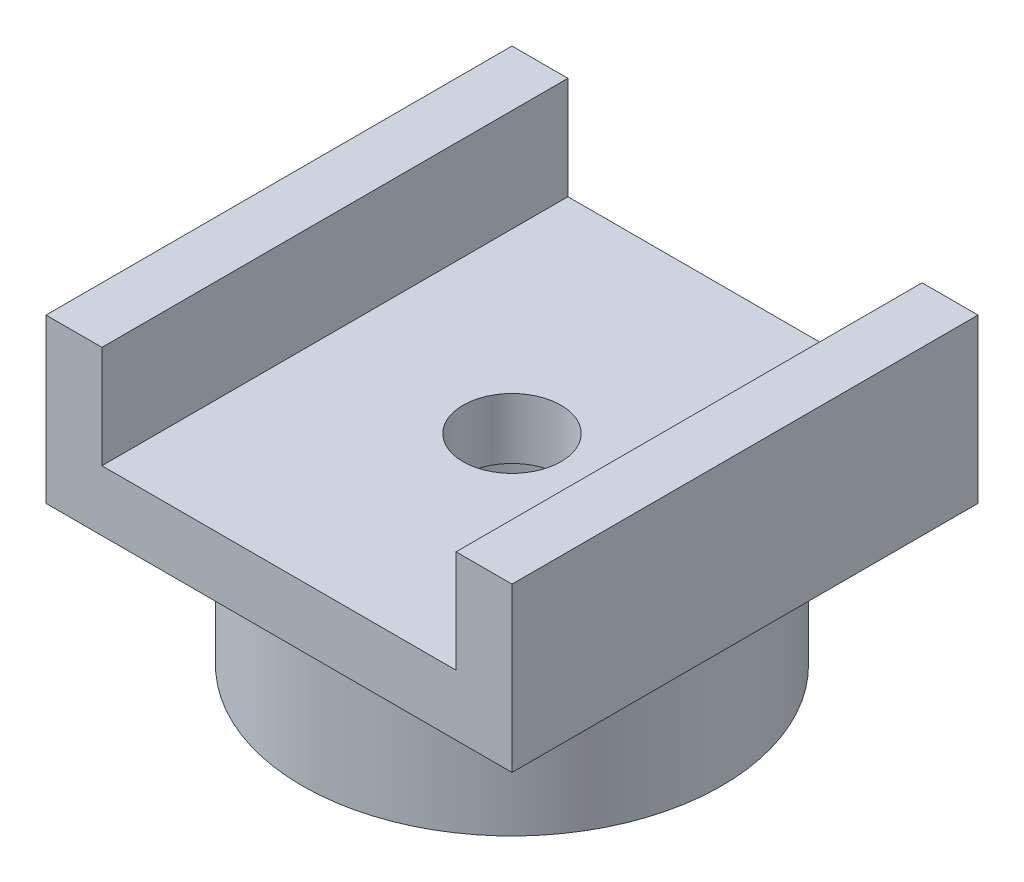
ISO-10303-21;
HEADER;
FILE_DESCRIPTION(('STEP AP214'),'2;1');
FILE_NAME('part.step','',(''),(''),'','','');
FILE_SCHEMA(('AUTOMOTIVE_DESIGN { 1 0 10303 214 1 1 1 1 }'));
ENDSEC;
DATA;
#1=APPLICATION_CONTEXT('core data for automotive mechanical design processes');
#2=APPLICATION_PROTOCOL_DEFINITION('international standard','automotive_design',2000,#1);
#3=PRODUCT_CONTEXT('',#1,'mechanical');
#4=PRODUCT('Part','Part','',(#3));
#5=PRODUCT_RELATED_PRODUCT_CATEGORY('part','',(#4));
#6=PRODUCT_DEFINITION_FORMATION('','',#4);
#7=PRODUCT_DEFINITION_CONTEXT('part definition',#1,'design');
#8=PRODUCT_DEFINITION('design','',#6,#7);
#9=PRODUCT_DEFINITION_SHAPE('','',#8);
#10=(LENGTH_UNIT() NAMED_UNIT(*) SI_UNIT(.MILLI.,.METRE.));
#11=(NAMED_UNIT(*) PLANE_ANGLE_UNIT() SI_UNIT($,.RADIAN.));
#12=(NAMED_UNIT(*) SI_UNIT($,.STERADIAN.) SOLID_ANGLE_UNIT());
#13=UNCERTAINTY_MEASURE_WITH_UNIT(LENGTH_MEASURE(1.E-05),#10,'distance_accuracy_value','');
#14=(GEOMETRIC_REPRESENTATION_CONTEXT(3) GLOBAL_UNCERTAINTY_ASSIGNED_CONTEXT((#13)) GLOBAL_UNIT_ASSIGNED_CONTEXT((#10,
#11,#12)) REPRESENTATION_CONTEXT('',''));
#15=CARTESIAN_POINT('',(0.,0.,0.));
#16=DIRECTION('',(0.,0.,1.));
#17=DIRECTION('',(1.,0.,0.));
#18=AXIS2_PLACEMENT_3D('',#15,#16,#17);
#19=CARTESIAN_POINT('',(5.,6.5,-5.));
#20=DIRECTION('',(0.,-1.,0.));
#21=DIRECTION('',(0.,0.,-1.));
#22=AXIS2_PLACEMENT_3D('',#19,#20,#21);
#23=PLANE('',#22);
#24=DIRECTION('',(1.,0.,0.));
#25=VECTOR('',#24,1.);
#26=CARTESIAN_POINT('',(-5.,6.5,5.));
#27=LINE('',#26,#25);
#28=CARTESIAN_POINT('',(-5.,6.5,5.));
#29=VERTEX_POINT('',#28);
#30=CARTESIAN_POINT('',(-3.8,6.5,5.));
#31=VERTEX_POINT('',#30);
#32=EDGE_CURVE('E150',#29,#31,#27,.T.);
#33=ORIENTED_EDGE('',*,*,#32,.T.);
#34=DIRECTION('',(0.,0.,1.));
#35=VECTOR('',#34,1.);
#36=CARTESIAN_POINT('',(-3.8,6.5,-5.));
#37=LINE('',#36,#35);
#38=CARTESIAN_POINT('',(-3.8,6.5,-5.));
#39=VERTEX_POINT('',#38);
#40=EDGE_CURVE('E113',#39,#31,#37,.T.);
#41=ORIENTED_EDGE('',*,*,#40,.F.);
#42=DIRECTION('',(-1.,0.,0.));
#43=VECTOR('',#42,1.);
#44=CARTESIAN_POINT('',(-5.,6.5,-5.));
#45=LINE('',#44,#43);
#46=CARTESIAN_POINT('',(-5.,6.5,-5.));
#47=VERTEX_POINT('',#46);
#48=EDGE_CURVE('E146',#39,#47,#45,.T.);
#49=ORIENTED_EDGE('',*,*,#48,.T.);
#50=DIRECTION('',(0.,0.,1.));
#51=VECTOR('',#50,1.);
#52=CARTESIAN_POINT('',(-5.,6.5,5.));
#53=LINE('',#52,#51);
#54=EDGE_CURVE('E148',#47,#29,#53,.T.);
#55=ORIENTED_EDGE('',*,*,#54,.T.);
#56=EDGE_LOOP('',(#33,#41,#49,#55));
#57=FACE_BOUND('',#56,.T.);
#58=ADVANCED_FACE('F32',(#57),#23,.F.);
#59=CARTESIAN_POINT('',(0.,3.,0.));
#60=DIRECTION('',(0.,-1.,0.));
#61=DIRECTION('',(0.,0.,-1.));
#62=AXIS2_PLACEMENT_3D('',#59,#60,#61);
#63=CYLINDRICAL_SURFACE('',#62,4.5);
#64=CARTESIAN_POINT('',(0.,3.,0.));
#65=DIRECTION('',(0.,1.,0.));
#66=DIRECTION('',(0.,0.,1.));
#67=AXIS2_PLACEMENT_3D('',#64,#65,#66);
#68=CIRCLE('',#67,4.5);
#69=CARTESIAN_POINT('',(0.,3.,4.5));
#70=VERTEX_POINT('',#69);
#71=EDGE_CURVE('E11',#70,#70,#68,.T.);
#72=ORIENTED_EDGE('',*,*,#71,.F.);
#73=EDGE_LOOP('',(#72));
#74=FACE_BOUND('',#73,.T.);
#75=CARTESIAN_POINT('',(0.,0.,0.));
#76=DIRECTION('',(0.,1.,0.));
#77=DIRECTION('',(0.,0.,1.));
#78=AXIS2_PLACEMENT_3D('',#75,#76,#77);
#79=CIRCLE('',#78,4.5);
#80=CARTESIAN_POINT('',(0.,0.,4.5));
#81=VERTEX_POINT('',#80);
#82=EDGE_CURVE('E36',#81,#81,#79,.T.);
#83=ORIENTED_EDGE('',*,*,#82,.T.);
#84=EDGE_LOOP('',(#83));
#85=FACE_BOUND('',#84,.T.);
#86=ADVANCED_FACE('F34',(#74,#85),#63,.T.);
#87=CARTESIAN_POINT('',(0.,0.,0.));
#88=DIRECTION('',(0.,1.,0.));
#89=DIRECTION('',(0.,0.,1.));
#90=AXIS2_PLACEMENT_3D('',#87,#88,#89);
#91=PLANE('',#90);
#92=CARTESIAN_POINT('',(0.,0.,0.));
#93=DIRECTION('',(0.,1.,0.));
#94=DIRECTION('',(0.,0.,1.));
#95=AXIS2_PLACEMENT_3D('',#92,#93,#94);
#96=CIRCLE('',#95,2.8);
#97=CARTESIAN_POINT('',(0.,0.,2.8));
#98=VERTEX_POINT('',#97);
#99=EDGE_CURVE('E171',#98,#98,#96,.T.);
#100=ORIENTED_EDGE('',*,*,#99,.T.);
#101=EDGE_LOOP('',(#100));
#102=FACE_BOUND('',#101,.T.);
#103=ORIENTED_EDGE('',*,*,#82,.F.);
#104=EDGE_LOOP('',(#103));
#105=FACE_BOUND('',#104,.T.);
#106=ADVANCED_FACE('F179',(#102,#105),#91,.F.);
#107=CARTESIAN_POINT('',(0.,0.,0.));
#108=DIRECTION('',(0.,1.,0.));
#109=DIRECTION('',(0.,0.,1.));
#110=AXIS2_PLACEMENT_3D('',#107,#108,#109);
#111=CYLINDRICAL_SURFACE('',#110,2.8);
#112=ORIENTED_EDGE('',*,*,#99,.F.);
#113=EDGE_LOOP('',(#112));
#114=FACE_BOUND('',#113,.T.);
#115=CARTESIAN_POINT('',(0.,3.,0.));
#116=DIRECTION('',(0.,-1.,0.));
#117=DIRECTION('',(0.,0.,-1.));
#118=AXIS2_PLACEMENT_3D('',#115,#116,#117);
#119=CIRCLE('',#118,2.8);
#120=CARTESIAN_POINT('',(0.,3.,-2.8));
#121=VERTEX_POINT('',#120);
#122=EDGE_CURVE('E168',#121,#121,#119,.F.);
#123=ORIENTED_EDGE('',*,*,#122,.T.);
#124=EDGE_LOOP('',(#123));
#125=FACE_BOUND('',#124,.T.);
#126=ADVANCED_FACE('F181',(#114,#125),#111,.F.);
#127=CARTESIAN_POINT('',(5.,3.,-5.));
#128=DIRECTION('',(0.,-1.,0.));
#129=DIRECTION('',(0.,0.,-1.));
#130=AXIS2_PLACEMENT_3D('',#127,#128,#129);
#131=PLANE('',#130);
#132=CARTESIAN_POINT('',(0.,3.,0.));
#133=DIRECTION('',(0.,-1.,0.));
#134=DIRECTION('',(0.,0.,-1.));
#135=AXIS2_PLACEMENT_3D('',#132,#133,#134);
#136=CIRCLE('',#135,1.0507025386795);
#137=CARTESIAN_POINT('',(0.,3.,-1.0507025386795));
#138=VERTEX_POINT('',#137);
#139=EDGE_CURVE('E136',#138,#138,#136,.T.);
#140=ORIENTED_EDGE('',*,*,#139,.F.);
#141=EDGE_LOOP('',(#140));
#142=FACE_BOUND('',#141,.T.);
#143=ORIENTED_EDGE('',*,*,#122,.F.);
#144=EDGE_LOOP('',(#143));
#145=FACE_BOUND('',#144,.T.);
#146=ADVANCED_FACE('F186',(#142,#145),#131,.T.);
#147=DIRECTION('',(0.,0.,-1.));
#148=VECTOR('',#147,1.);
#149=CARTESIAN_POINT('',(5.,3.,5.));
#150=LINE('',#149,#148);
#151=CARTESIAN_POINT('',(5.,3.,5.));
#152=VERTEX_POINT('',#151);
#153=CARTESIAN_POINT('',(5.,3.,-5.));
#154=VERTEX_POINT('',#153);
#155=EDGE_CURVE('E140',#152,#154,#150,.T.);
#156=ORIENTED_EDGE('',*,*,#155,.F.);
#157=DIRECTION('',(1.,0.,0.));
#158=VECTOR('',#157,1.);
#159=CARTESIAN_POINT('',(-5.,3.,5.));
#160=LINE('',#159,#158);
#161=CARTESIAN_POINT('',(-5.,3.,5.));
#162=VERTEX_POINT('',#161);
#163=EDGE_CURVE('E77',#162,#152,#160,.T.);
#164=ORIENTED_EDGE('',*,*,#163,.F.);
#165=DIRECTION('',(0.,0.,1.));
#166=VECTOR('',#165,1.);
#167=CARTESIAN_POINT('',(-5.,3.,5.));
#168=LINE('',#167,#166);
#169=CARTESIAN_POINT('',(-5.,3.,-5.));
#170=VERTEX_POINT('',#169);
#171=EDGE_CURVE('E157',#170,#162,#168,.T.);
#172=ORIENTED_EDGE('',*,*,#171,.F.);
#173=DIRECTION('',(-1.,0.,0.));
#174=VECTOR('',#173,1.);
#175=CARTESIAN_POINT('',(-5.,3.,-5.));
#176=LINE('',#175,#174);
#177=EDGE_CURVE('E155',#154,#170,#176,.T.);
#178=ORIENTED_EDGE('',*,*,#177,.F.);
#179=EDGE_LOOP('',(#156,#164,#172,#178));
#180=FACE_BOUND('',#179,.T.);
#181=ORIENTED_EDGE('',*,*,#71,.T.);
#182=EDGE_LOOP('',(#181));
#183=FACE_BOUND('',#182,.T.);
#184=ADVANCED_FACE('F219',(#180,#183),#131,.T.);
#185=CARTESIAN_POINT('',(5.,6.5,5.));
#186=DIRECTION('',(-1.,0.,0.));
#187=DIRECTION('',(0.,0.,1.));
#188=AXIS2_PLACEMENT_3D('',#185,#186,#187);
#189=PLANE('',#188);
#190=ORIENTED_EDGE('',*,*,#155,.T.);
#191=DIRECTION('',(0.,-1.,0.));
#192=VECTOR('',#191,1.);
#193=CARTESIAN_POINT('',(5.,6.5,-5.));
#194=LINE('',#193,#192);
#195=CARTESIAN_POINT('',(5.,6.5,-5.));
#196=VERTEX_POINT('',#195);
#197=EDGE_CURVE('E166',#196,#154,#194,.T.);
#198=ORIENTED_EDGE('',*,*,#197,.F.);
#199=DIRECTION('',(0.,0.,-1.));
#200=VECTOR('',#199,1.);
#201=CARTESIAN_POINT('',(5.,6.5,5.));
#202=LINE('',#201,#200);
#203=CARTESIAN_POINT('',(5.,6.5,5.));
#204=VERTEX_POINT('',#203);
#205=EDGE_CURVE('E144',#204,#196,#202,.T.);
#206=ORIENTED_EDGE('',*,*,#205,.F.);
#207=DIRECTION('',(0.,-1.,0.));
#208=VECTOR('',#207,1.);
#209=CARTESIAN_POINT('',(5.,6.5,5.));
#210=LINE('',#209,#208);
#211=EDGE_CURVE('E152',#204,#152,#210,.T.);
#212=ORIENTED_EDGE('',*,*,#211,.T.);
#213=EDGE_LOOP('',(#190,#198,#206,#212));
#214=FACE_BOUND('',#213,.T.);
#215=ADVANCED_FACE('F209',(#214),#189,.F.);
#216=CARTESIAN_POINT('',(-5.,6.5,-5.));
#217=DIRECTION('',(0.,0.,1.));
#218=DIRECTION('',(1.,0.,0.));
#219=AXIS2_PLACEMENT_3D('',#216,#217,#218);
#220=PLANE('',#219);
#221=ORIENTED_EDGE('',*,*,#48,.F.);
#222=DIRECTION('',(0.,1.,0.));
#223=VECTOR('',#222,1.);
#224=CARTESIAN_POINT('',(-3.8,4.3,-5.));
#225=LINE('',#224,#223);
#226=CARTESIAN_POINT('',(-3.8,4.3,-5.));
#227=VERTEX_POINT('',#226);
#228=EDGE_CURVE('E138',#227,#39,#225,.T.);
#229=ORIENTED_EDGE('',*,*,#228,.F.);
#230=DIRECTION('',(-1.,0.,0.));
#231=VECTOR('',#230,1.);
#232=CARTESIAN_POINT('',(-3.8,4.3,-5.));
#233=LINE('',#232,#231);
#234=CARTESIAN_POINT('',(3.8,4.3,-5.));
#235=VERTEX_POINT('',#234);
#236=EDGE_CURVE('E117',#235,#227,#233,.T.);
#237=ORIENTED_EDGE('',*,*,#236,.F.);
#238=DIRECTION('',(0.,1.,0.));
#239=VECTOR('',#238,1.);
#240=CARTESIAN_POINT('',(3.8,4.3,-5.));
#241=LINE('',#240,#239);
#242=CARTESIAN_POINT('',(3.8,6.5,-5.));
#243=VERTEX_POINT('',#242);
#244=EDGE_CURVE('E141',#235,#243,#241,.T.);
#245=ORIENTED_EDGE('',*,*,#244,.T.);
#246=EDGE_CURVE('E85',#196,#243,#45,.T.);
#247=ORIENTED_EDGE('',*,*,#246,.F.);
#248=ORIENTED_EDGE('',*,*,#197,.T.);
#249=ORIENTED_EDGE('',*,*,#177,.T.);
#250=DIRECTION('',(0.,-1.,0.));
#251=VECTOR('',#250,1.);
#252=CARTESIAN_POINT('',(-5.,6.5,-5.));
#253=LINE('',#252,#251);
#254=EDGE_CURVE('E163',#47,#170,#253,.T.);
#255=ORIENTED_EDGE('',*,*,#254,.F.);
#256=EDGE_LOOP('',(#221,#229,#237,#245,#247,#248,#249,#255));
#257=FACE_BOUND('',#256,.T.);
#258=ADVANCED_FACE('F212',(#257),#220,.F.);
#259=CARTESIAN_POINT('',(-5.,6.5,5.));
#260=DIRECTION('',(1.,0.,0.));
#261=DIRECTION('',(0.,0.,-1.));
#262=AXIS2_PLACEMENT_3D('',#259,#260,#261);
#263=PLANE('',#262);
#264=ORIENTED_EDGE('',*,*,#171,.T.);
#265=DIRECTION('',(0.,-1.,0.));
#266=VECTOR('',#265,1.);
#267=CARTESIAN_POINT('',(-5.,6.5,5.));
#268=LINE('',#267,#266);
#269=EDGE_CURVE('E161',#29,#162,#268,.T.);
#270=ORIENTED_EDGE('',*,*,#269,.F.);
#271=ORIENTED_EDGE('',*,*,#54,.F.);
#272=ORIENTED_EDGE('',*,*,#254,.T.);
#273=EDGE_LOOP('',(#264,#270,#271,#272));
#274=FACE_BOUND('',#273,.T.);
#275=ADVANCED_FACE('F204',(#274),#263,.F.);
#276=CARTESIAN_POINT('',(-5.,6.5,5.));
#277=DIRECTION('',(0.,0.,-1.));
#278=DIRECTION('',(-1.,0.,0.));
#279=AXIS2_PLACEMENT_3D('',#276,#277,#278);
#280=PLANE('',#279);
#281=DIRECTION('',(1.,0.,0.));
#282=VECTOR('',#281,1.);
#283=CARTESIAN_POINT('',(-3.8,4.3,5.));
#284=LINE('',#283,#282);
#285=CARTESIAN_POINT('',(-3.8,4.3,5.));
#286=VERTEX_POINT('',#285);
#287=CARTESIAN_POINT('',(3.8,4.3,5.));
#288=VERTEX_POINT('',#287);
#289=EDGE_CURVE('E123',#286,#288,#284,.T.);
#290=ORIENTED_EDGE('',*,*,#289,.F.);
#291=DIRECTION('',(0.,1.,0.));
#292=VECTOR('',#291,1.);
#293=CARTESIAN_POINT('',(-3.8,4.3,5.));
#294=LINE('',#293,#292);
#295=EDGE_CURVE('E107',#286,#31,#294,.T.);
#296=ORIENTED_EDGE('',*,*,#295,.T.);
#297=ORIENTED_EDGE('',*,*,#32,.F.);
#298=ORIENTED_EDGE('',*,*,#269,.T.);
#299=ORIENTED_EDGE('',*,*,#163,.T.);
#300=ORIENTED_EDGE('',*,*,#211,.F.);
#301=CARTESIAN_POINT('',(3.8,6.5,5.));
#302=VERTEX_POINT('',#301);
#303=EDGE_CURVE('E55',#302,#204,#27,.T.);
#304=ORIENTED_EDGE('',*,*,#303,.F.);
#305=DIRECTION('',(0.,1.,0.));
#306=VECTOR('',#305,1.);
#307=CARTESIAN_POINT('',(3.8,4.3,5.));
#308=LINE('',#307,#306);
#309=EDGE_CURVE('E47',#288,#302,#308,.T.);
#310=ORIENTED_EDGE('',*,*,#309,.F.);
#311=EDGE_LOOP('',(#290,#296,#297,#298,#299,#300,#304,#310));
#312=FACE_BOUND('',#311,.T.);
#313=ADVANCED_FACE('F128',(#312),#280,.F.);
#314=ORIENTED_EDGE('',*,*,#246,.T.);
#315=DIRECTION('',(0.,0.,-1.));
#316=VECTOR('',#315,1.);
#317=CARTESIAN_POINT('',(3.8,6.5,-5.));
#318=LINE('',#317,#316);
#319=EDGE_CURVE('E126',#302,#243,#318,.T.);
#320=ORIENTED_EDGE('',*,*,#319,.F.);
#321=ORIENTED_EDGE('',*,*,#303,.T.);
#322=ORIENTED_EDGE('',*,*,#205,.T.);
#323=EDGE_LOOP('',(#314,#320,#321,#322));
#324=FACE_BOUND('',#323,.T.);
#325=ADVANCED_FACE('F193',(#324),#23,.F.);
#326=CARTESIAN_POINT('',(-3.8,4.3,-5.));
#327=DIRECTION('',(-1.,0.,0.));
#328=DIRECTION('',(0.,0.,1.));
#329=AXIS2_PLACEMENT_3D('',#326,#327,#328);
#330=PLANE('',#329);
#331=ORIENTED_EDGE('',*,*,#40,.T.);
#332=ORIENTED_EDGE('',*,*,#295,.F.);
#333=DIRECTION('',(0.,0.,1.));
#334=VECTOR('',#333,1.);
#335=CARTESIAN_POINT('',(-3.8,4.3,-5.));
#336=LINE('',#335,#334);
#337=EDGE_CURVE('E110',#227,#286,#336,.T.);
#338=ORIENTED_EDGE('',*,*,#337,.F.);
#339=ORIENTED_EDGE('',*,*,#228,.T.);
#340=EDGE_LOOP('',(#331,#332,#338,#339));
#341=FACE_BOUND('',#340,.T.);
#342=ADVANCED_FACE('F109',(#341),#330,.F.);
#343=CARTESIAN_POINT('',(3.8,4.3,-5.));
#344=DIRECTION('',(1.,0.,0.));
#345=DIRECTION('',(0.,0.,-1.));
#346=AXIS2_PLACEMENT_3D('',#343,#344,#345);
#347=PLANE('',#346);
#348=ORIENTED_EDGE('',*,*,#319,.T.);
#349=ORIENTED_EDGE('',*,*,#244,.F.);
#350=DIRECTION('',(0.,0.,-1.));
#351=VECTOR('',#350,1.);
#352=CARTESIAN_POINT('',(3.8,4.3,-5.));
#353=LINE('',#352,#351);
#354=EDGE_CURVE('E129',#288,#235,#353,.T.);
#355=ORIENTED_EDGE('',*,*,#354,.F.);
#356=ORIENTED_EDGE('',*,*,#309,.T.);
#357=EDGE_LOOP('',(#348,#349,#355,#356));
#358=FACE_BOUND('',#357,.T.);
#359=ADVANCED_FACE('F203',(#358),#347,.F.);
#360=CARTESIAN_POINT('',(-3.8,4.3,5.));
#361=DIRECTION('',(0.,1.,0.));
#362=DIRECTION('',(0.,0.,1.));
#363=AXIS2_PLACEMENT_3D('',#360,#361,#362);
#364=PLANE('',#363);
#365=CARTESIAN_POINT('',(0.,4.3,0.));
#366=DIRECTION('',(0.,1.,0.));
#367=DIRECTION('',(0.,0.,1.));
#368=AXIS2_PLACEMENT_3D('',#365,#366,#367);
#369=CIRCLE('',#368,1.0507025386795);
#370=CARTESIAN_POINT('',(0.,4.3,1.0507025386795));
#371=VERTEX_POINT('',#370);
#372=EDGE_CURVE('E300',#371,#371,#369,.T.);
#373=ORIENTED_EDGE('',*,*,#372,.F.);
#374=EDGE_LOOP('',(#373));
#375=FACE_BOUND('',#374,.T.);
#376=ORIENTED_EDGE('',*,*,#337,.T.);
#377=ORIENTED_EDGE('',*,*,#289,.T.);
#378=ORIENTED_EDGE('',*,*,#354,.T.);
#379=ORIENTED_EDGE('',*,*,#236,.T.);
#380=EDGE_LOOP('',(#376,#377,#378,#379));
#381=FACE_BOUND('',#380,.T.);
#382=ADVANCED_FACE('F121',(#375,#381),#364,.T.);
#383=CARTESIAN_POINT('',(0.,0.,0.));
#384=DIRECTION('',(0.,1.,0.));
#385=DIRECTION('',(0.,0.,1.));
#386=AXIS2_PLACEMENT_3D('',#383,#384,#385);
#387=CYLINDRICAL_SURFACE('',#386,1.0507025386795);
#388=ORIENTED_EDGE('',*,*,#139,.T.);
#389=EDGE_LOOP('',(#388));
#390=FACE_BOUND('',#389,.T.);
#391=ORIENTED_EDGE('',*,*,#372,.T.);
#392=EDGE_LOOP('',(#391));
#393=FACE_BOUND('',#392,.T.);
#394=ADVANCED_FACE('F281',(#390,#393),#387,.F.);
#395=CLOSED_SHELL('',(#58,#86,#106,#126,#146,#184,#215,#258,#275,#313,#325,#342,#359,#382,#394));
#396=MANIFOLD_SOLID_BREP('B2',#395);
#397=ADVANCED_BREP_SHAPE_REPRESENTATION('',(#18,#396),#14);
#398=SHAPE_DEFINITION_REPRESENTATION(#9,#397);
ENDSEC;
END-ISO-10303-21;
